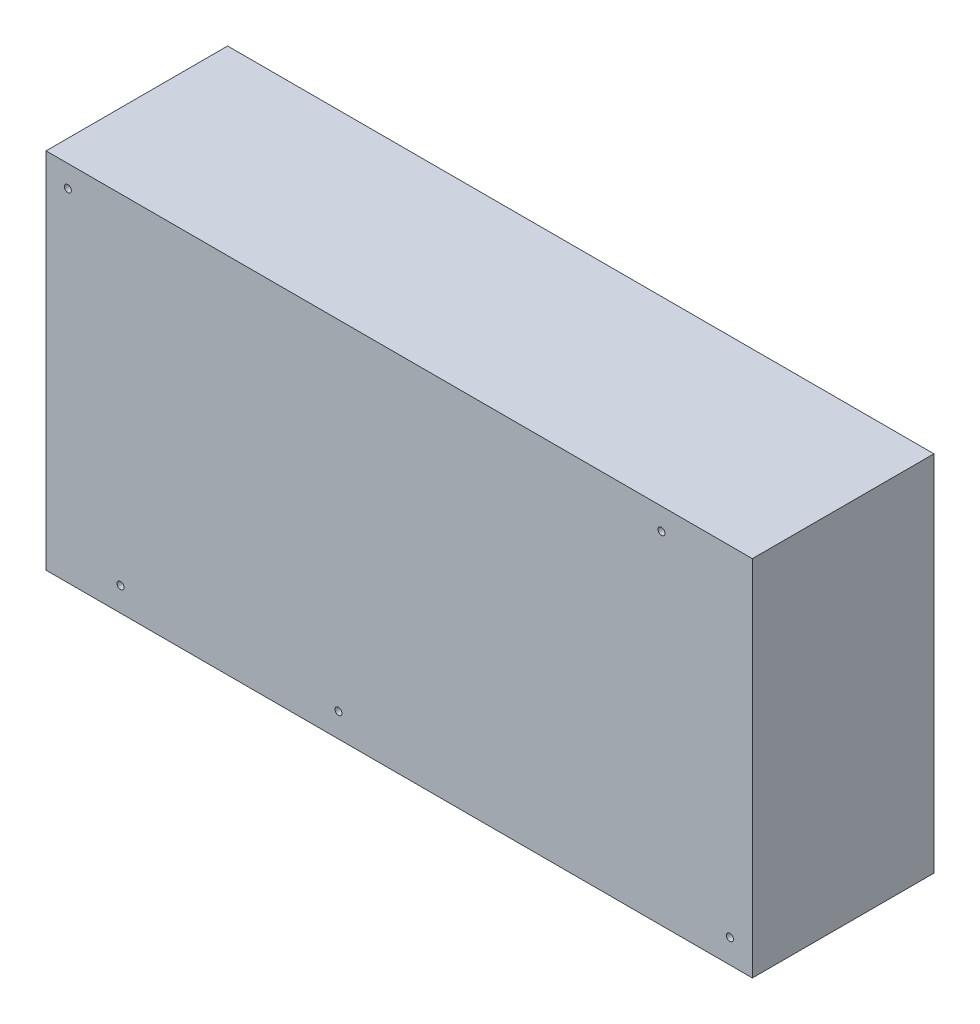
ISO-10303-21;
HEADER;
FILE_DESCRIPTION(('STEP AP214'),'2;1');
FILE_NAME('part.step','',(''),(''),'','','');
FILE_SCHEMA(('AUTOMOTIVE_DESIGN { 1 0 10303 214 1 1 1 1 }'));
ENDSEC;
DATA;
#1=APPLICATION_CONTEXT('core data for automotive mechanical design processes');
#2=APPLICATION_PROTOCOL_DEFINITION('international standard','automotive_design',2000,#1);
#3=PRODUCT_CONTEXT('',#1,'mechanical');
#4=PRODUCT('Part','Part','',(#3));
#5=PRODUCT_RELATED_PRODUCT_CATEGORY('part','',(#4));
#6=PRODUCT_DEFINITION_FORMATION('','',#4);
#7=PRODUCT_DEFINITION_CONTEXT('part definition',#1,'design');
#8=PRODUCT_DEFINITION('design','',#6,#7);
#9=PRODUCT_DEFINITION_SHAPE('','',#8);
#10=(LENGTH_UNIT() NAMED_UNIT(*) SI_UNIT(.MILLI.,.METRE.));
#11=(NAMED_UNIT(*) PLANE_ANGLE_UNIT() SI_UNIT($,.RADIAN.));
#12=(NAMED_UNIT(*) SI_UNIT($,.STERADIAN.) SOLID_ANGLE_UNIT());
#13=UNCERTAINTY_MEASURE_WITH_UNIT(LENGTH_MEASURE(1.E-05),#10,'distance_accuracy_value','');
#14=(GEOMETRIC_REPRESENTATION_CONTEXT(3) GLOBAL_UNCERTAINTY_ASSIGNED_CONTEXT((#13)) GLOBAL_UNIT_ASSIGNED_CONTEXT((#10,
#11,#12)) REPRESENTATION_CONTEXT('',''));
#15=CARTESIAN_POINT('',(0.,0.,0.));
#16=DIRECTION('',(0.,0.,1.));
#17=DIRECTION('',(1.,0.,0.));
#18=AXIS2_PLACEMENT_3D('',#15,#16,#17);
#19=CARTESIAN_POINT('',(-123.5,-63.5,63.5));
#20=DIRECTION('',(1.,0.,0.));
#21=DIRECTION('',(0.,0.,-1.));
#22=AXIS2_PLACEMENT_3D('',#19,#20,#21);
#23=PLANE('',#22);
#24=DIRECTION('',(0.,-1.,0.));
#25=VECTOR('',#24,1.);
#26=CARTESIAN_POINT('',(-123.5,-63.5,0.));
#27=LINE('',#26,#25);
#28=CARTESIAN_POINT('',(-123.5,63.5,0.));
#29=VERTEX_POINT('',#28);
#30=CARTESIAN_POINT('',(-123.5,-63.5,0.));
#31=VERTEX_POINT('',#30);
#32=EDGE_CURVE('E96',#29,#31,#27,.T.);
#33=ORIENTED_EDGE('',*,*,#32,.T.);
#34=DIRECTION('',(0.,0.,-1.));
#35=VECTOR('',#34,1.);
#36=CARTESIAN_POINT('',(-123.5,-63.5,63.5));
#37=LINE('',#36,#35);
#38=CARTESIAN_POINT('',(-123.5,-63.5,63.5));
#39=VERTEX_POINT('',#38);
#40=EDGE_CURVE('E11',#39,#31,#37,.T.);
#41=ORIENTED_EDGE('',*,*,#40,.F.);
#42=DIRECTION('',(0.,-1.,0.));
#43=VECTOR('',#42,1.);
#44=CARTESIAN_POINT('',(-123.5,-63.5,63.5));
#45=LINE('',#44,#43);
#46=CARTESIAN_POINT('',(-123.5,63.5,63.5));
#47=VERTEX_POINT('',#46);
#48=EDGE_CURVE('E84',#47,#39,#45,.T.);
#49=ORIENTED_EDGE('',*,*,#48,.F.);
#50=DIRECTION('',(0.,0.,-1.));
#51=VECTOR('',#50,1.);
#52=CARTESIAN_POINT('',(-123.5,63.5,63.5));
#53=LINE('',#52,#51);
#54=EDGE_CURVE('E92',#47,#29,#53,.T.);
#55=ORIENTED_EDGE('',*,*,#54,.T.);
#56=EDGE_LOOP('',(#33,#41,#49,#55));
#57=FACE_BOUND('',#56,.T.);
#58=ADVANCED_FACE('F33',(#57),#23,.F.);
#59=CARTESIAN_POINT('',(123.5,-63.5,63.5));
#60=DIRECTION('',(0.,1.,0.));
#61=DIRECTION('',(-1.,0.,0.));
#62=AXIS2_PLACEMENT_3D('',#59,#60,#61);
#63=PLANE('',#62);
#64=DIRECTION('',(1.,0.,0.));
#65=VECTOR('',#64,1.);
#66=CARTESIAN_POINT('',(123.5,-63.5,0.));
#67=LINE('',#66,#65);
#68=CARTESIAN_POINT('',(123.5,-63.5,0.));
#69=VERTEX_POINT('',#68);
#70=EDGE_CURVE('E88',#31,#69,#67,.T.);
#71=ORIENTED_EDGE('',*,*,#70,.T.);
#72=DIRECTION('',(0.,0.,-1.));
#73=VECTOR('',#72,1.);
#74=CARTESIAN_POINT('',(123.5,-63.5,63.5));
#75=LINE('',#74,#73);
#76=CARTESIAN_POINT('',(123.5,-63.5,63.5));
#77=VERTEX_POINT('',#76);
#78=EDGE_CURVE('E41',#77,#69,#75,.T.);
#79=ORIENTED_EDGE('',*,*,#78,.F.);
#80=DIRECTION('',(1.,0.,0.));
#81=VECTOR('',#80,1.);
#82=CARTESIAN_POINT('',(123.5,-63.5,63.5));
#83=LINE('',#82,#81);
#84=EDGE_CURVE('E79',#39,#77,#83,.T.);
#85=ORIENTED_EDGE('',*,*,#84,.F.);
#86=ORIENTED_EDGE('',*,*,#40,.T.);
#87=EDGE_LOOP('',(#71,#79,#85,#86));
#88=FACE_BOUND('',#87,.T.);
#89=ADVANCED_FACE('F87',(#88),#63,.F.);
#90=CARTESIAN_POINT('',(123.5,-63.5,63.5));
#91=DIRECTION('',(-1.,0.,0.));
#92=DIRECTION('',(0.,0.,1.));
#93=AXIS2_PLACEMENT_3D('',#90,#91,#92);
#94=PLANE('',#93);
#95=DIRECTION('',(0.,1.,0.));
#96=VECTOR('',#95,1.);
#97=CARTESIAN_POINT('',(123.5,-63.5,0.));
#98=LINE('',#97,#96);
#99=CARTESIAN_POINT('',(123.5,63.5,0.));
#100=VERTEX_POINT('',#99);
#101=EDGE_CURVE('E66',#69,#100,#98,.T.);
#102=ORIENTED_EDGE('',*,*,#101,.T.);
#103=DIRECTION('',(0.,0.,-1.));
#104=VECTOR('',#103,1.);
#105=CARTESIAN_POINT('',(123.5,63.5,63.5));
#106=LINE('',#105,#104);
#107=CARTESIAN_POINT('',(123.5,63.5,63.5));
#108=VERTEX_POINT('',#107);
#109=EDGE_CURVE('E89',#108,#100,#106,.T.);
#110=ORIENTED_EDGE('',*,*,#109,.F.);
#111=DIRECTION('',(0.,1.,0.));
#112=VECTOR('',#111,1.);
#113=CARTESIAN_POINT('',(123.5,-63.5,63.5));
#114=LINE('',#113,#112);
#115=EDGE_CURVE('E82',#77,#108,#114,.T.);
#116=ORIENTED_EDGE('',*,*,#115,.F.);
#117=ORIENTED_EDGE('',*,*,#78,.T.);
#118=EDGE_LOOP('',(#102,#110,#116,#117));
#119=FACE_BOUND('',#118,.T.);
#120=ADVANCED_FACE('F90',(#119),#94,.F.);
#121=CARTESIAN_POINT('',(123.5,63.5,63.5));
#122=DIRECTION('',(0.,-1.,0.));
#123=DIRECTION('',(1.,0.,0.));
#124=AXIS2_PLACEMENT_3D('',#121,#122,#123);
#125=PLANE('',#124);
#126=DIRECTION('',(-1.,0.,0.));
#127=VECTOR('',#126,1.);
#128=CARTESIAN_POINT('',(123.5,63.5,0.));
#129=LINE('',#128,#127);
#130=EDGE_CURVE('E72',#100,#29,#129,.T.);
#131=ORIENTED_EDGE('',*,*,#130,.T.);
#132=ORIENTED_EDGE('',*,*,#54,.F.);
#133=DIRECTION('',(-1.,0.,0.));
#134=VECTOR('',#133,1.);
#135=CARTESIAN_POINT('',(123.5,63.5,63.5));
#136=LINE('',#135,#134);
#137=EDGE_CURVE('E49',#108,#47,#136,.T.);
#138=ORIENTED_EDGE('',*,*,#137,.F.);
#139=ORIENTED_EDGE('',*,*,#109,.T.);
#140=EDGE_LOOP('',(#131,#132,#138,#139));
#141=FACE_BOUND('',#140,.T.);
#142=ADVANCED_FACE('F104',(#141),#125,.F.);
#143=CARTESIAN_POINT('',(0.,0.,63.5));
#144=DIRECTION('',(0.,0.,1.));
#145=DIRECTION('',(1.,0.,0.));
#146=AXIS2_PLACEMENT_3D('',#143,#144,#145);
#147=PLANE('',#146);
#148=CARTESIAN_POINT('',(-115.88,55.88,63.5));
#149=DIRECTION('',(0.,0.,1.));
#150=DIRECTION('',(1.,0.,0.));
#151=AXIS2_PLACEMENT_3D('',#148,#149,#150);
#152=CIRCLE('',#151,1.21919999999999);
#153=CARTESIAN_POINT('',(-114.6608,55.88,63.5));
#154=VERTEX_POINT('',#153);
#155=EDGE_CURVE('E136',#154,#154,#152,.T.);
#156=ORIENTED_EDGE('',*,*,#155,.F.);
#157=EDGE_LOOP('',(#156));
#158=FACE_BOUND('',#157,.T.);
#159=CARTESIAN_POINT('',(-97.465,-55.118,63.5));
#160=DIRECTION('',(0.,0.,1.));
#161=DIRECTION('',(1.,0.,0.));
#162=AXIS2_PLACEMENT_3D('',#159,#160,#161);
#163=CIRCLE('',#162,1.21919999999999);
#164=CARTESIAN_POINT('',(-96.2458,-55.118,63.5));
#165=VERTEX_POINT('',#164);
#166=EDGE_CURVE('E130',#165,#165,#163,.T.);
#167=ORIENTED_EDGE('',*,*,#166,.F.);
#168=EDGE_LOOP('',(#167));
#169=FACE_BOUND('',#168,.T.);
#170=CARTESIAN_POINT('',(-21.265,-55.118,63.5));
#171=DIRECTION('',(0.,0.,1.));
#172=DIRECTION('',(1.,0.,0.));
#173=AXIS2_PLACEMENT_3D('',#170,#171,#172);
#174=CIRCLE('',#173,1.21919999999999);
#175=CARTESIAN_POINT('',(-20.0458,-55.118,63.5));
#176=VERTEX_POINT('',#175);
#177=EDGE_CURVE('E124',#176,#176,#174,.T.);
#178=ORIENTED_EDGE('',*,*,#177,.F.);
#179=EDGE_LOOP('',(#178));
#180=FACE_BOUND('',#179,.T.);
#181=CARTESIAN_POINT('',(115.641,-55.118,63.5));
#182=DIRECTION('',(0.,0.,1.));
#183=DIRECTION('',(1.,0.,0.));
#184=AXIS2_PLACEMENT_3D('',#181,#182,#183);
#185=CIRCLE('',#184,1.21919999999999);
#186=CARTESIAN_POINT('',(116.8602,-55.118,63.5));
#187=VERTEX_POINT('',#186);
#188=EDGE_CURVE('E118',#187,#187,#185,.T.);
#189=ORIENTED_EDGE('',*,*,#188,.F.);
#190=EDGE_LOOP('',(#189));
#191=FACE_BOUND('',#190,.T.);
#192=CARTESIAN_POINT('',(91.7015,55.8800000000001,63.5));
#193=DIRECTION('',(0.,0.,1.));
#194=DIRECTION('',(1.,0.,0.));
#195=AXIS2_PLACEMENT_3D('',#192,#193,#194);
#196=CIRCLE('',#195,1.21919999999999);
#197=CARTESIAN_POINT('',(92.9207,55.8800000000001,63.5));
#198=VERTEX_POINT('',#197);
#199=EDGE_CURVE('E112',#198,#198,#196,.T.);
#200=ORIENTED_EDGE('',*,*,#199,.F.);
#201=EDGE_LOOP('',(#200));
#202=FACE_BOUND('',#201,.T.);
#203=ORIENTED_EDGE('',*,*,#48,.T.);
#204=ORIENTED_EDGE('',*,*,#84,.T.);
#205=ORIENTED_EDGE('',*,*,#115,.T.);
#206=ORIENTED_EDGE('',*,*,#137,.T.);
#207=EDGE_LOOP('',(#203,#204,#205,#206));
#208=FACE_BOUND('',#207,.T.);
#209=ADVANCED_FACE('F80',(#158,#169,#180,#191,#202,#208),#147,.T.);
#210=CARTESIAN_POINT('',(0.,0.,0.));
#211=DIRECTION('',(0.,0.,1.));
#212=DIRECTION('',(1.,0.,0.));
#213=AXIS2_PLACEMENT_3D('',#210,#211,#212);
#214=PLANE('',#213);
#215=CARTESIAN_POINT('',(-115.88,55.88,0.));
#216=DIRECTION('',(0.,0.,1.));
#217=DIRECTION('',(1.,0.,0.));
#218=AXIS2_PLACEMENT_3D('',#215,#216,#217);
#219=CIRCLE('',#218,1.21919999999999);
#220=CARTESIAN_POINT('',(-114.6608,55.88,0.));
#221=VERTEX_POINT('',#220);
#222=EDGE_CURVE('E133',#221,#221,#219,.T.);
#223=ORIENTED_EDGE('',*,*,#222,.T.);
#224=EDGE_LOOP('',(#223));
#225=FACE_BOUND('',#224,.T.);
#226=CARTESIAN_POINT('',(-97.465,-55.118,0.));
#227=DIRECTION('',(0.,0.,1.));
#228=DIRECTION('',(1.,0.,0.));
#229=AXIS2_PLACEMENT_3D('',#226,#227,#228);
#230=CIRCLE('',#229,1.21919999999999);
#231=CARTESIAN_POINT('',(-96.2458,-55.118,0.));
#232=VERTEX_POINT('',#231);
#233=EDGE_CURVE('E127',#232,#232,#230,.T.);
#234=ORIENTED_EDGE('',*,*,#233,.T.);
#235=EDGE_LOOP('',(#234));
#236=FACE_BOUND('',#235,.T.);
#237=CARTESIAN_POINT('',(-21.265,-55.118,0.));
#238=DIRECTION('',(0.,0.,1.));
#239=DIRECTION('',(1.,0.,0.));
#240=AXIS2_PLACEMENT_3D('',#237,#238,#239);
#241=CIRCLE('',#240,1.21919999999998);
#242=CARTESIAN_POINT('',(-20.0458,-55.118,0.));
#243=VERTEX_POINT('',#242);
#244=EDGE_CURVE('E121',#243,#243,#241,.T.);
#245=ORIENTED_EDGE('',*,*,#244,.T.);
#246=EDGE_LOOP('',(#245));
#247=FACE_BOUND('',#246,.T.);
#248=CARTESIAN_POINT('',(115.641,-55.118,0.));
#249=DIRECTION('',(0.,0.,1.));
#250=DIRECTION('',(1.,0.,0.));
#251=AXIS2_PLACEMENT_3D('',#248,#249,#250);
#252=CIRCLE('',#251,1.21919999999999);
#253=CARTESIAN_POINT('',(116.8602,-55.118,0.));
#254=VERTEX_POINT('',#253);
#255=EDGE_CURVE('E115',#254,#254,#252,.T.);
#256=ORIENTED_EDGE('',*,*,#255,.T.);
#257=EDGE_LOOP('',(#256));
#258=FACE_BOUND('',#257,.T.);
#259=CARTESIAN_POINT('',(91.7015,55.8800000000001,0.));
#260=DIRECTION('',(0.,0.,1.));
#261=DIRECTION('',(1.,0.,0.));
#262=AXIS2_PLACEMENT_3D('',#259,#260,#261);
#263=CIRCLE('',#262,1.21919999999999);
#264=CARTESIAN_POINT('',(92.9207,55.8800000000001,0.));
#265=VERTEX_POINT('',#264);
#266=EDGE_CURVE('E99',#265,#265,#263,.T.);
#267=ORIENTED_EDGE('',*,*,#266,.T.);
#268=EDGE_LOOP('',(#267));
#269=FACE_BOUND('',#268,.T.);
#270=ORIENTED_EDGE('',*,*,#32,.F.);
#271=ORIENTED_EDGE('',*,*,#130,.F.);
#272=ORIENTED_EDGE('',*,*,#101,.F.);
#273=ORIENTED_EDGE('',*,*,#70,.F.);
#274=EDGE_LOOP('',(#270,#271,#272,#273));
#275=FACE_BOUND('',#274,.T.);
#276=ADVANCED_FACE('F107',(#225,#236,#247,#258,#269,#275),#214,.F.);
#277=CARTESIAN_POINT('',(91.7015,55.8800000000001,63.5));
#278=DIRECTION('',(0.,0.,1.));
#279=DIRECTION('',(1.,0.,0.));
#280=AXIS2_PLACEMENT_3D('',#277,#278,#279);
#281=CYLINDRICAL_SURFACE('',#280,1.21919999999999);
#282=ORIENTED_EDGE('',*,*,#266,.F.);
#283=EDGE_LOOP('',(#282));
#284=FACE_BOUND('',#283,.T.);
#285=ORIENTED_EDGE('',*,*,#199,.T.);
#286=EDGE_LOOP('',(#285));
#287=FACE_BOUND('',#286,.T.);
#288=ADVANCED_FACE('F153',(#284,#287),#281,.F.);
#289=CARTESIAN_POINT('',(115.641,-55.118,63.5));
#290=DIRECTION('',(0.,0.,1.));
#291=DIRECTION('',(1.,0.,0.));
#292=AXIS2_PLACEMENT_3D('',#289,#290,#291);
#293=CYLINDRICAL_SURFACE('',#292,1.21919999999999);
#294=ORIENTED_EDGE('',*,*,#255,.F.);
#295=EDGE_LOOP('',(#294));
#296=FACE_BOUND('',#295,.T.);
#297=ORIENTED_EDGE('',*,*,#188,.T.);
#298=EDGE_LOOP('',(#297));
#299=FACE_BOUND('',#298,.T.);
#300=ADVANCED_FACE('F155',(#296,#299),#293,.F.);
#301=CARTESIAN_POINT('',(-21.265,-55.118,63.5));
#302=DIRECTION('',(0.,0.,1.));
#303=DIRECTION('',(1.,0.,0.));
#304=AXIS2_PLACEMENT_3D('',#301,#302,#303);
#305=CYLINDRICAL_SURFACE('',#304,1.21919999999999);
#306=ORIENTED_EDGE('',*,*,#244,.F.);
#307=EDGE_LOOP('',(#306));
#308=FACE_BOUND('',#307,.T.);
#309=ORIENTED_EDGE('',*,*,#177,.T.);
#310=EDGE_LOOP('',(#309));
#311=FACE_BOUND('',#310,.T.);
#312=ADVANCED_FACE('F162',(#308,#311),#305,.F.);
#313=CARTESIAN_POINT('',(-97.465,-55.118,63.5));
#314=DIRECTION('',(0.,0.,1.));
#315=DIRECTION('',(1.,0.,0.));
#316=AXIS2_PLACEMENT_3D('',#313,#314,#315);
#317=CYLINDRICAL_SURFACE('',#316,1.21919999999999);
#318=ORIENTED_EDGE('',*,*,#233,.F.);
#319=EDGE_LOOP('',(#318));
#320=FACE_BOUND('',#319,.T.);
#321=ORIENTED_EDGE('',*,*,#166,.T.);
#322=EDGE_LOOP('',(#321));
#323=FACE_BOUND('',#322,.T.);
#324=ADVANCED_FACE('F211',(#320,#323),#317,.F.);
#325=CARTESIAN_POINT('',(-115.88,55.88,63.5));
#326=DIRECTION('',(0.,0.,1.));
#327=DIRECTION('',(1.,0.,0.));
#328=AXIS2_PLACEMENT_3D('',#325,#326,#327);
#329=CYLINDRICAL_SURFACE('',#328,1.21919999999999);
#330=ORIENTED_EDGE('',*,*,#222,.F.);
#331=EDGE_LOOP('',(#330));
#332=FACE_BOUND('',#331,.T.);
#333=ORIENTED_EDGE('',*,*,#155,.T.);
#334=EDGE_LOOP('',(#333));
#335=FACE_BOUND('',#334,.T.);
#336=ADVANCED_FACE('F140',(#332,#335),#329,.F.);
#337=CLOSED_SHELL('',(#58,#89,#120,#142,#209,#276,#288,#300,#312,#324,#336));
#338=MANIFOLD_SOLID_BREP('B2',#337);
#339=ADVANCED_BREP_SHAPE_REPRESENTATION('',(#18,#338),#14);
#340=SHAPE_DEFINITION_REPRESENTATION(#9,#339);
ENDSEC;
END-ISO-10303-21;
